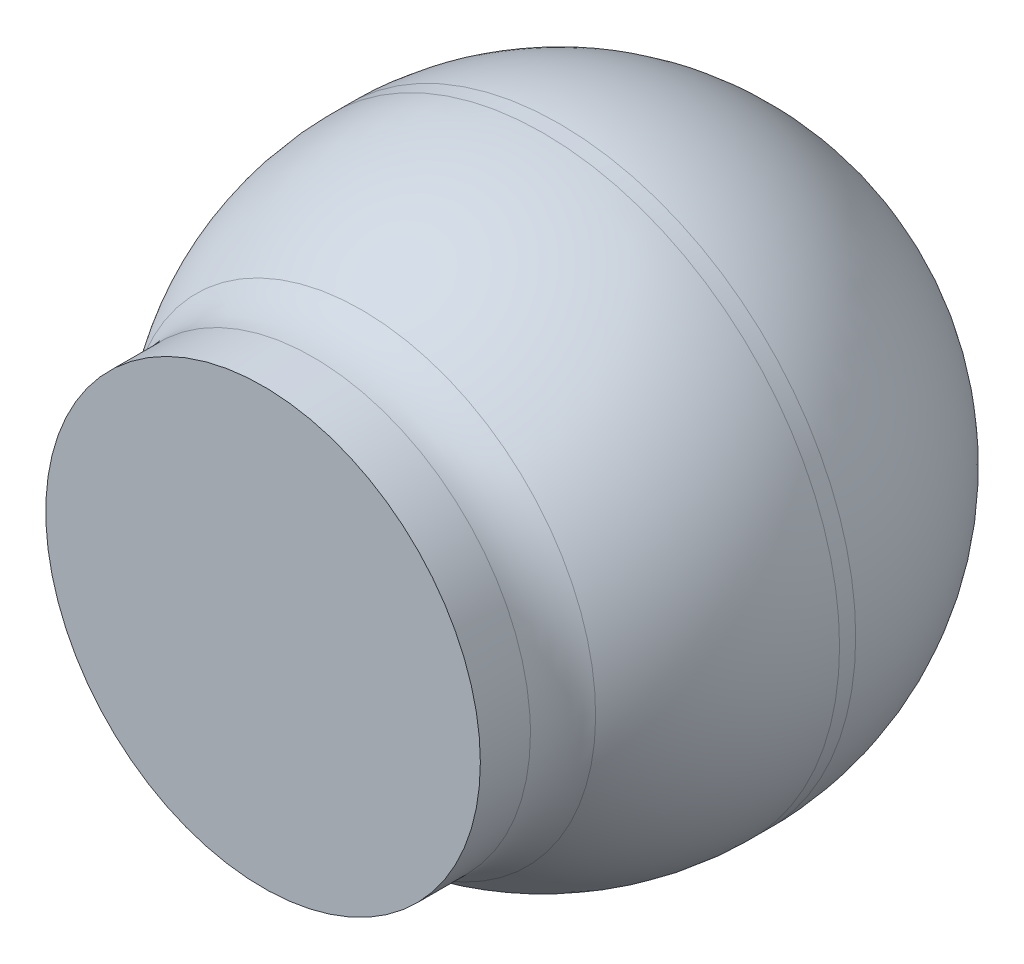
ISO-10303-21;
HEADER;
FILE_DESCRIPTION(('STEP AP214'),'2;1');
FILE_NAME('part.step','',(''),(''),'','','');
FILE_SCHEMA(('AUTOMOTIVE_DESIGN { 1 0 10303 214 1 1 1 1 }'));
ENDSEC;
DATA;
#1=APPLICATION_CONTEXT('core data for automotive mechanical design processes');
#2=APPLICATION_PROTOCOL_DEFINITION('international standard','automotive_design',2000,#1);
#3=PRODUCT_CONTEXT('',#1,'mechanical');
#4=PRODUCT('Part','Part','',(#3));
#5=PRODUCT_RELATED_PRODUCT_CATEGORY('part','',(#4));
#6=PRODUCT_DEFINITION_FORMATION('','',#4);
#7=PRODUCT_DEFINITION_CONTEXT('part definition',#1,'design');
#8=PRODUCT_DEFINITION('design','',#6,#7);
#9=PRODUCT_DEFINITION_SHAPE('','',#8);
#10=(LENGTH_UNIT() NAMED_UNIT(*) SI_UNIT(.MILLI.,.METRE.));
#11=(NAMED_UNIT(*) PLANE_ANGLE_UNIT() SI_UNIT($,.RADIAN.));
#12=(NAMED_UNIT(*) SI_UNIT($,.STERADIAN.) SOLID_ANGLE_UNIT());
#13=UNCERTAINTY_MEASURE_WITH_UNIT(LENGTH_MEASURE(1.E-05),#10,'distance_accuracy_value','');
#14=(GEOMETRIC_REPRESENTATION_CONTEXT(3) GLOBAL_UNCERTAINTY_ASSIGNED_CONTEXT((#13)) GLOBAL_UNIT_ASSIGNED_CONTEXT((#10,
#11,#12)) REPRESENTATION_CONTEXT('',''));
#15=CARTESIAN_POINT('',(0.,0.,0.));
#16=DIRECTION('',(0.,0.,1.));
#17=DIRECTION('',(1.,0.,0.));
#18=AXIS2_PLACEMENT_3D('',#15,#16,#17);
#19=CARTESIAN_POINT('',(-1.832919922269,-0.241349291452,10.006534503384));
#20=DIRECTION('',(0.,0.,-1.));
#21=DIRECTION('',(-1.,0.,0.));
#22=AXIS2_PLACEMENT_3D('',#19,#20,#21);
#23=PLANE('',#22);
#24=CARTESIAN_POINT('',(-1.832919922269,-0.241349291452,10.006534503384));
#25=DIRECTION('',(0.,0.,1.));
#26=DIRECTION('',(1.,0.,0.));
#27=AXIS2_PLACEMENT_3D('',#24,#25,#26);
#28=CIRCLE('',#27,0.275);
#29=CARTESIAN_POINT('',(-1.557919922269,-0.241349291452,10.006534503384));
#30=VERTEX_POINT('',#29);
#31=EDGE_CURVE('E20',#30,#30,#28,.F.);
#32=ORIENTED_EDGE('',*,*,#31,.F.);
#33=EDGE_LOOP('',(#32));
#34=FACE_BOUND('',#33,.T.);
#35=ADVANCED_FACE('F17',(#34),#23,.F.);
#36=CARTESIAN_POINT('',(-1.832919922269,-0.241349291452,9.906534503384));
#37=DIRECTION('',(0.,0.,1.));
#38=DIRECTION('',(1.,0.,0.));
#39=AXIS2_PLACEMENT_3D('',#36,#37,#38);
#40=CYLINDRICAL_SURFACE('',#39,0.275);
#41=CARTESIAN_POINT('',(-1.832919922269,-0.241349291452,9.943180457728));
#42=DIRECTION('',(0.,0.,-1.));
#43=DIRECTION('',(0.996700902337582,0.0811622527992459,0.));
#44=AXIS2_PLACEMENT_3D('',#41,#42,#43);
#45=CIRCLE('',#44,0.275);
#46=CARTESIAN_POINT('',(-1.55882717412616,-0.219029671932207,9.943180457728));
#47=VERTEX_POINT('',#46);
#48=EDGE_CURVE('E65',#47,#47,#45,.F.);
#49=ORIENTED_EDGE('',*,*,#48,.T.);
#50=EDGE_LOOP('',(#49));
#51=FACE_BOUND('',#50,.T.);
#52=ORIENTED_EDGE('',*,*,#31,.T.);
#53=EDGE_LOOP('',(#52));
#54=FACE_BOUND('',#53,.T.);
#55=ADVANCED_FACE('F62',(#51,#54),#40,.T.);
#56=CARTESIAN_POINT('',(-1.832919922269,-0.241349291452,9.943180457728));
#57=DIRECTION('',(0.,0.,-1.));
#58=DIRECTION('',(0.996700902337583,0.081162252799246,0.));
#59=AXIS2_PLACEMENT_3D('',#56,#57,#58);
#60=TOROIDAL_SURFACE('',#59,0.375,0.1);
#61=ORIENTED_EDGE('',*,*,#48,.F.);
#62=EDGE_LOOP('',(#61));
#63=FACE_BOUND('',#62,.T.);
#64=CARTESIAN_POINT('',(-1.832919922269,-0.241349291452,9.881744931236));
#65=DIRECTION('',(0.,0.,-1.));
#66=DIRECTION('',(-0.996700902337598,-0.0811622527990606,0.));
#67=AXIS2_PLACEMENT_3D('',#64,#65,#66);
#68=CIRCLE('',#67,0.296097046412665);
#69=CARTESIAN_POINT('',(-2.128040115608,-0.265381194786,9.881744931236));
#70=VERTEX_POINT('',#69);
#71=EDGE_CURVE('E39',#70,#70,#68,.T.);
#72=ORIENTED_EDGE('',*,*,#71,.F.);
#73=EDGE_LOOP('',(#72));
#74=FACE_BOUND('',#73,.T.);
#75=ADVANCED_FACE('F57',(#63,#74),#60,.F.);
#76=CARTESIAN_POINT('',(-2.206682760645,-0.271785136252,9.651976062157));
#77=CARTESIAN_POINT('',(-2.206682760645,-0.271785136252,9.701461392103));
#78=CARTESIAN_POINT('',(-2.198526217348,-0.271120941579,9.750947004335));
#79=CARTESIAN_POINT('',(-2.182207085349,-0.269792059952,9.798626332798));
#80=CARTESIAN_POINT('',(-2.158341390838,-0.267848654938,9.842699544317));
#81=CARTESIAN_POINT('',(-2.128040115608,-0.265381194786,9.881744931236));
#82=(BOUNDED_CURVE() B_SPLINE_CURVE(5,(#76,#77,#78,#79,#80,#81),.UNSPECIFIED.,.F.,
.F.) B_SPLINE_CURVE_WITH_KNOTS((6,6),(0.,0.661568582165),
.UNSPECIFIED.) CURVE() GEOMETRIC_REPRESENTATION_ITEM() RATIONAL_B_SPLINE_CURVE((1.,1.,1.,1.,1.,1.)) REPRESENTATION_ITEM(''));
#83=CARTESIAN_POINT('',(-1.832919922269,-0.241349291452,9.651976062157));
#84=DIRECTION('',(0.,0.,-1.));
#85=AXIS1_PLACEMENT('',#83,#84);
#86=SURFACE_OF_REVOLUTION('',#82,#85);
#87=CARTESIAN_POINT('',(-1.832919922269,-0.241349291452,9.651976062157));
#88=DIRECTION('',(0.,0.,1.));
#89=DIRECTION('',(1.,0.,0.));
#90=AXIS2_PLACEMENT_3D('',#87,#88,#89);
#91=CIRCLE('',#90,0.375);
#92=CARTESIAN_POINT('',(-1.457919922269,-0.241349291452,9.651976062157));
#93=VERTEX_POINT('',#92);
#94=EDGE_CURVE('E36',#93,#93,#91,.F.);
#95=ORIENTED_EDGE('',*,*,#94,.F.);
#96=EDGE_LOOP('',(#95));
#97=FACE_BOUND('',#96,.T.);
#98=ORIENTED_EDGE('',*,*,#71,.T.);
#99=EDGE_LOOP('',(#98));
#100=FACE_BOUND('',#99,.T.);
#101=ADVANCED_FACE('F53',(#97,#100),#86,.F.);
#102=CARTESIAN_POINT('',(-1.832919922269,-0.241349291452,9.256534503384));
#103=DIRECTION('',(0.,0.,1.));
#104=DIRECTION('',(1.,0.,0.));
#105=AXIS2_PLACEMENT_3D('',#102,#103,#104);
#106=CYLINDRICAL_SURFACE('',#105,0.375);
#107=CARTESIAN_POINT('',(-1.832919922269,-0.241349291452,9.631534503384));
#108=DIRECTION('',(0.,0.,-1.));
#109=DIRECTION('',(0.0811622527992362,-0.996700902337583,0.));
#110=AXIS2_PLACEMENT_3D('',#107,#108,#109);
#111=CIRCLE('',#110,0.375);
#112=CARTESIAN_POINT('',(-1.80248407746929,-0.615112129828594,9.631534503384));
#113=VERTEX_POINT('',#112);
#114=CARTESIAN_POINT('',(-1.86335576706871,0.132413546924594,9.631534503384));
#115=VERTEX_POINT('',#114);
#116=EDGE_CURVE('E11',#113,#115,#111,.T.);
#117=ORIENTED_EDGE('',*,*,#116,.F.);
#118=CARTESIAN_POINT('',(-1.832919922269,-0.241349291452,9.631534503384));
#119=DIRECTION('',(0.,0.,1.));
#120=DIRECTION('',(0.081162252799236,-0.996700902337583,0.));
#121=AXIS2_PLACEMENT_3D('',#118,#119,#120);
#122=CIRCLE('',#121,0.375);
#123=EDGE_CURVE('E25',#115,#113,#122,.F.);
#124=ORIENTED_EDGE('',*,*,#123,.F.);
#125=EDGE_LOOP('',(#117,#124));
#126=FACE_BOUND('',#125,.T.);
#127=ORIENTED_EDGE('',*,*,#94,.T.);
#128=EDGE_LOOP('',(#127));
#129=FACE_BOUND('',#128,.T.);
#130=ADVANCED_FACE('F34',(#126,#129),#106,.T.);
#131=CARTESIAN_POINT('',(-1.832919922269,-0.241349291452,9.631534503384));
#132=DIRECTION('',(0.0811622527992361,-0.996700902337583,0.));
#133=DIRECTION('',(-0.996700902337583,-0.0811622527992361,0.));
#134=AXIS2_PLACEMENT_3D('',#131,#132,#133);
#135=SPHERICAL_SURFACE('',#134,0.375);
#136=ORIENTED_EDGE('',*,*,#123,.T.);
#137=ORIENTED_EDGE('',*,*,#116,.T.);
#138=EDGE_LOOP('',(#136,#137));
#139=FACE_BOUND('',#138,.T.);
#140=ADVANCED_FACE('F32',(#139),#135,.T.);
#141=CLOSED_SHELL('',(#35,#55,#75,#101,#130,#140));
#142=MANIFOLD_SOLID_BREP('B1',#141);
#143=ADVANCED_BREP_SHAPE_REPRESENTATION('',(#18,#142),#14);
#144=SHAPE_DEFINITION_REPRESENTATION(#9,#143);
ENDSEC;
END-ISO-10303-21;
